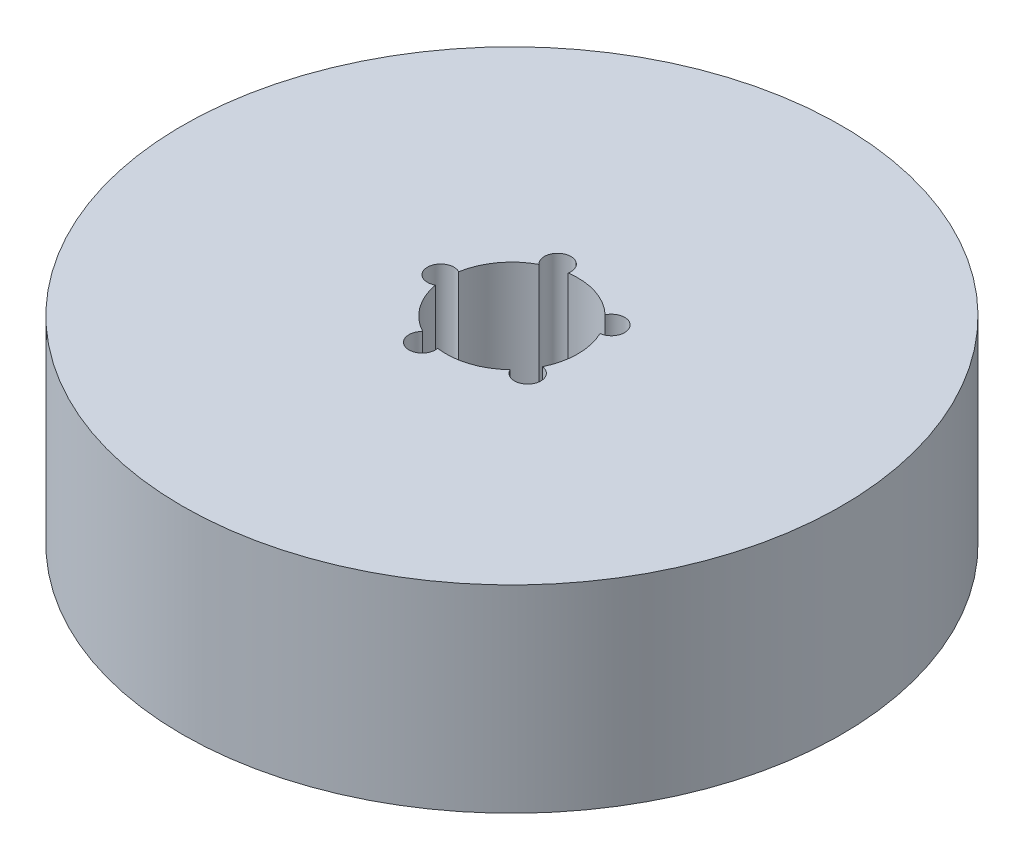
ISO-10303-21;
HEADER;
FILE_DESCRIPTION(('STEP AP214'),'2;1');
FILE_NAME('part.step','',(''),(''),'','','');
FILE_SCHEMA(('AUTOMOTIVE_DESIGN { 1 0 10303 214 1 1 1 1 }'));
ENDSEC;
DATA;
#1=APPLICATION_CONTEXT('core data for automotive mechanical design processes');
#2=APPLICATION_PROTOCOL_DEFINITION('international standard','automotive_design',2000,#1);
#3=PRODUCT_CONTEXT('',#1,'mechanical');
#4=PRODUCT('Part','Part','',(#3));
#5=PRODUCT_RELATED_PRODUCT_CATEGORY('part','',(#4));
#6=PRODUCT_DEFINITION_FORMATION('','',#4);
#7=PRODUCT_DEFINITION_CONTEXT('part definition',#1,'design');
#8=PRODUCT_DEFINITION('design','',#6,#7);
#9=PRODUCT_DEFINITION_SHAPE('','',#8);
#10=(LENGTH_UNIT() NAMED_UNIT(*) SI_UNIT(.MILLI.,.METRE.));
#11=(NAMED_UNIT(*) PLANE_ANGLE_UNIT() SI_UNIT($,.RADIAN.));
#12=(NAMED_UNIT(*) SI_UNIT($,.STERADIAN.) SOLID_ANGLE_UNIT());
#13=UNCERTAINTY_MEASURE_WITH_UNIT(LENGTH_MEASURE(1.E-05),#10,'distance_accuracy_value','');
#14=(GEOMETRIC_REPRESENTATION_CONTEXT(3) GLOBAL_UNCERTAINTY_ASSIGNED_CONTEXT((#13)) GLOBAL_UNIT_ASSIGNED_CONTEXT((#10,
#11,#12)) REPRESENTATION_CONTEXT('',''));
#15=CARTESIAN_POINT('',(0.,0.,0.));
#16=DIRECTION('',(0.,0.,1.));
#17=DIRECTION('',(1.,0.,0.));
#18=AXIS2_PLACEMENT_3D('',#15,#16,#17);
#19=CARTESIAN_POINT('',(0.,30.,0.));
#20=DIRECTION('',(0.,-1.,0.));
#21=DIRECTION('',(0.,0.,-1.));
#22=AXIS2_PLACEMENT_3D('',#19,#20,#21);
#23=CYLINDRICAL_SURFACE('',#22,50.);
#24=CARTESIAN_POINT('',(0.,30.,0.));
#25=DIRECTION('',(0.,1.,0.));
#26=DIRECTION('',(0.,0.,1.));
#27=AXIS2_PLACEMENT_3D('',#24,#25,#26);
#28=CIRCLE('',#27,50.);
#29=CARTESIAN_POINT('',(0.,30.,50.));
#30=VERTEX_POINT('',#29);
#31=EDGE_CURVE('E157',#30,#30,#28,.T.);
#32=ORIENTED_EDGE('',*,*,#31,.F.);
#33=EDGE_LOOP('',(#32));
#34=FACE_BOUND('',#33,.T.);
#35=CARTESIAN_POINT('',(0.,0.,0.));
#36=DIRECTION('',(0.,1.,0.));
#37=DIRECTION('',(0.,0.,1.));
#38=AXIS2_PLACEMENT_3D('',#35,#36,#37);
#39=CIRCLE('',#38,50.);
#40=CARTESIAN_POINT('',(0.,0.,50.));
#41=VERTEX_POINT('',#40);
#42=EDGE_CURVE('E150',#41,#41,#39,.T.);
#43=ORIENTED_EDGE('',*,*,#42,.T.);
#44=EDGE_LOOP('',(#43));
#45=FACE_BOUND('',#44,.T.);
#46=ADVANCED_FACE('F39',(#34,#45),#23,.T.);
#47=CARTESIAN_POINT('',(0.,30.,0.));
#48=DIRECTION('',(0.,1.,0.));
#49=DIRECTION('',(0.,0.,1.));
#50=AXIS2_PLACEMENT_3D('',#47,#48,#49);
#51=PLANE('',#50);
#52=CARTESIAN_POINT('',(-3.33869277643538,30.,-10.2754397937207));
#53=DIRECTION('',(0.,1.,0.));
#54=DIRECTION('',(-0.95105651629515,0.,0.309016994374958));
#55=AXIS2_PLACEMENT_3D('',#52,#53,#54);
#56=CIRCLE('',#55,2.00900339087471);
#57=CARTESIAN_POINT('',(-1.36384540924019,30.,-9.90655973078921));
#58=VERTEX_POINT('',#57);
#59=CARTESIAN_POINT('',(-4.71955559693702,30.,-8.81622339595705));
#60=VERTEX_POINT('',#59);
#61=EDGE_CURVE('E194',#58,#60,#56,.T.);
#62=ORIENTED_EDGE('',*,*,#61,.F.);
#63=CARTESIAN_POINT('',(0.,30.,0.));
#64=DIRECTION('',(0.,1.,0.));
#65=DIRECTION('',(0.,0.,1.));
#66=AXIS2_PLACEMENT_3D('',#63,#64,#65);
#67=CIRCLE('',#66,10.);
#68=CARTESIAN_POINT('',(6.92630382448782,30.,-7.21292696004094));
#69=VERTEX_POINT('',#68);
#70=EDGE_CURVE('E147',#69,#58,#67,.T.);
#71=ORIENTED_EDGE('',*,*,#70,.F.);
#72=CARTESIAN_POINT('',(8.74081116670121,30.,-6.3505710418727));
#73=DIRECTION('',(0.,1.,0.));
#74=DIRECTION('',(-0.58778525229248,0.,-0.809016994374942));
#75=AXIS2_PLACEMENT_3D('',#72,#73,#74);
#76=CIRCLE('',#75,2.00900339087471);
#77=CARTESIAN_POINT('',(9.00024677687878,30.,-4.35838937628146));
#78=VERTEX_POINT('',#77);
#79=EDGE_CURVE('E254',#78,#69,#76,.T.);
#80=ORIENTED_EDGE('',*,*,#79,.F.);
#81=CARTESIAN_POINT('',(9.00024677687884,30.,4.35838937628133));
#82=VERTEX_POINT('',#81);
#83=EDGE_CURVE('E144',#82,#78,#67,.T.);
#84=ORIENTED_EDGE('',*,*,#83,.F.);
#85=CARTESIAN_POINT('',(8.7408111667013,30.,6.35057104187258));
#86=DIRECTION('',(0.,1.,0.));
#87=DIRECTION('',(0.587785252292469,0.,-0.809016994374951));
#88=AXIS2_PLACEMENT_3D('',#85,#86,#87);
#89=CIRCLE('',#88,2.00900339087471);
#90=CARTESIAN_POINT('',(6.92630382448792,30.,7.21292696004084));
#91=VERTEX_POINT('',#90);
#92=EDGE_CURVE('E141',#91,#82,#89,.T.);
#93=ORIENTED_EDGE('',*,*,#92,.F.);
#94=CARTESIAN_POINT('',(-1.36384540924005,30.,9.90655973078923));
#95=VERTEX_POINT('',#94);
#96=EDGE_CURVE('E134',#95,#91,#67,.T.);
#97=ORIENTED_EDGE('',*,*,#96,.F.);
#98=CARTESIAN_POINT('',(-3.33869277643523,30.,10.2754397937208));
#99=DIRECTION('',(0.,1.,0.));
#100=DIRECTION('',(0.951056516295155,0.,0.309016994374945));
#101=AXIS2_PLACEMENT_3D('',#98,#99,#100);
#102=CIRCLE('',#101,2.00900339087471);
#103=CARTESIAN_POINT('',(-4.71955559693689,30.,8.81622339595712));
#104=VERTEX_POINT('',#103);
#105=EDGE_CURVE('E111',#104,#95,#102,.T.);
#106=ORIENTED_EDGE('',*,*,#105,.F.);
#107=CARTESIAN_POINT('',(-9.8431495951897,30.,1.76420124892737));
#108=VERTEX_POINT('',#107);
#109=EDGE_CURVE('E145',#108,#104,#67,.T.);
#110=ORIENTED_EDGE('',*,*,#109,.F.);
#111=CARTESIAN_POINT('',(-10.804236780532,30.,0.));
#112=DIRECTION('',(0.,1.,0.));
#113=DIRECTION('',(0.,0.,1.));
#114=AXIS2_PLACEMENT_3D('',#111,#112,#113);
#115=CIRCLE('',#114,2.00900339087471);
#116=CARTESIAN_POINT('',(-9.8431495951897,30.,-1.76420124892737));
#117=VERTEX_POINT('',#116);
#118=EDGE_CURVE('E153',#117,#108,#115,.T.);
#119=ORIENTED_EDGE('',*,*,#118,.F.);
#120=EDGE_CURVE('E146',#60,#117,#67,.T.);
#121=ORIENTED_EDGE('',*,*,#120,.F.);
#122=EDGE_LOOP('',(#62,#71,#80,#84,#93,#97,#106,#110,#119,#121));
#123=FACE_BOUND('',#122,.T.);
#124=ORIENTED_EDGE('',*,*,#31,.T.);
#125=EDGE_LOOP('',(#124));
#126=FACE_BOUND('',#125,.T.);
#127=ADVANCED_FACE('F139',(#123,#126),#51,.T.);
#128=CARTESIAN_POINT('',(0.,0.,0.));
#129=DIRECTION('',(0.,1.,0.));
#130=DIRECTION('',(0.,0.,1.));
#131=AXIS2_PLACEMENT_3D('',#128,#129,#130);
#132=PLANE('',#131);
#133=CARTESIAN_POINT('',(0.,0.,0.));
#134=DIRECTION('',(0.,1.,0.));
#135=DIRECTION('',(0.,0.,1.));
#136=AXIS2_PLACEMENT_3D('',#133,#134,#135);
#137=CIRCLE('',#136,10.);
#138=CARTESIAN_POINT('',(0.,0.,10.));
#139=VERTEX_POINT('',#138);
#140=EDGE_CURVE('E154',#139,#139,#137,.T.);
#141=ORIENTED_EDGE('',*,*,#140,.T.);
#142=EDGE_LOOP('',(#141));
#143=FACE_BOUND('',#142,.T.);
#144=ORIENTED_EDGE('',*,*,#42,.F.);
#145=EDGE_LOOP('',(#144));
#146=FACE_BOUND('',#145,.T.);
#147=ADVANCED_FACE('F213',(#143,#146),#132,.F.);
#148=CARTESIAN_POINT('',(0.,30.,0.));
#149=DIRECTION('',(0.,-1.,0.));
#150=DIRECTION('',(0.,0.,-1.));
#151=AXIS2_PLACEMENT_3D('',#148,#149,#150);
#152=CYLINDRICAL_SURFACE('',#151,10.);
#153=DIRECTION('',(0.,1.,0.));
#154=VECTOR('',#153,1.);
#155=CARTESIAN_POINT('',(-1.36384540924019,17.4263082114023,-9.90655973078921));
#156=LINE('',#155,#154);
#157=CARTESIAN_POINT('',(-1.36384540924019,4.85261642280456,-9.90655973078921));
#158=VERTEX_POINT('',#157);
#159=EDGE_CURVE('E11',#158,#58,#156,.T.);
#160=ORIENTED_EDGE('',*,*,#159,.F.);
#161=CARTESIAN_POINT('',(0.,4.85261642280456,0.));
#162=DIRECTION('',(0.,1.,0.));
#163=DIRECTION('',(0.,0.,1.));
#164=AXIS2_PLACEMENT_3D('',#161,#162,#163);
#165=CIRCLE('',#164,10.);
#166=CARTESIAN_POINT('',(-4.71955559693702,4.85261642280456,-8.81622339595705));
#167=VERTEX_POINT('',#166);
#168=EDGE_CURVE('E189',#158,#167,#165,.T.);
#169=ORIENTED_EDGE('',*,*,#168,.T.);
#170=DIRECTION('',(0.,1.,0.));
#171=VECTOR('',#170,1.);
#172=CARTESIAN_POINT('',(-4.71955559693702,17.4263082114023,-8.81622339595705));
#173=LINE('',#172,#171);
#174=EDGE_CURVE('E46',#60,#167,#173,.F.);
#175=ORIENTED_EDGE('',*,*,#174,.F.);
#176=ORIENTED_EDGE('',*,*,#120,.T.);
#177=DIRECTION('',(0.,1.,0.));
#178=VECTOR('',#177,1.);
#179=CARTESIAN_POINT('',(-9.8431495951897,17.4263082114023,-1.76420124892737));
#180=LINE('',#179,#178);
#181=CARTESIAN_POINT('',(-9.8431495951897,4.85261642280456,-1.76420124892737));
#182=VERTEX_POINT('',#181);
#183=EDGE_CURVE('E168',#182,#117,#180,.T.);
#184=ORIENTED_EDGE('',*,*,#183,.F.);
#185=CARTESIAN_POINT('',(0.,4.85261642280456,0.));
#186=DIRECTION('',(0.,1.,0.));
#187=DIRECTION('',(0.,0.,1.));
#188=AXIS2_PLACEMENT_3D('',#185,#186,#187);
#189=CIRCLE('',#188,10.);
#190=CARTESIAN_POINT('',(-9.8431495951897,4.85261642280456,1.76420124892737));
#191=VERTEX_POINT('',#190);
#192=EDGE_CURVE('E165',#182,#191,#189,.T.);
#193=ORIENTED_EDGE('',*,*,#192,.T.);
#194=DIRECTION('',(0.,1.,0.));
#195=VECTOR('',#194,1.);
#196=CARTESIAN_POINT('',(-9.8431495951897,17.4263082114023,1.76420124892737));
#197=LINE('',#196,#195);
#198=EDGE_CURVE('E170',#108,#191,#197,.F.);
#199=ORIENTED_EDGE('',*,*,#198,.F.);
#200=ORIENTED_EDGE('',*,*,#109,.T.);
#201=DIRECTION('',(0.,1.,0.));
#202=VECTOR('',#201,1.);
#203=CARTESIAN_POINT('',(-4.7195555969369,17.4263082114023,8.81622339595712));
#204=LINE('',#203,#202);
#205=CARTESIAN_POINT('',(-4.71955559693689,4.85261642280456,8.81622339595712));
#206=VERTEX_POINT('',#205);
#207=EDGE_CURVE('E121',#206,#104,#204,.T.);
#208=ORIENTED_EDGE('',*,*,#207,.F.);
#209=CARTESIAN_POINT('',(0.,4.85261642280456,0.));
#210=DIRECTION('',(0.,1.,0.));
#211=DIRECTION('',(0.,0.,1.));
#212=AXIS2_PLACEMENT_3D('',#209,#210,#211);
#213=CIRCLE('',#212,10.);
#214=CARTESIAN_POINT('',(-1.36384540924005,4.85261642280456,9.90655973078923));
#215=VERTEX_POINT('',#214);
#216=EDGE_CURVE('E136',#206,#215,#213,.T.);
#217=ORIENTED_EDGE('',*,*,#216,.T.);
#218=DIRECTION('',(0.,1.,0.));
#219=VECTOR('',#218,1.);
#220=CARTESIAN_POINT('',(-1.36384540924005,17.4263082114023,9.90655973078923));
#221=LINE('',#220,#219);
#222=EDGE_CURVE('E117',#95,#215,#221,.F.);
#223=ORIENTED_EDGE('',*,*,#222,.F.);
#224=ORIENTED_EDGE('',*,*,#96,.T.);
#225=DIRECTION('',(0.,1.,0.));
#226=VECTOR('',#225,1.);
#227=CARTESIAN_POINT('',(6.92630382448792,17.4263082114023,7.21292696004084));
#228=LINE('',#227,#226);
#229=CARTESIAN_POINT('',(6.92630382448792,4.85261642280456,7.21292696004084));
#230=VERTEX_POINT('',#229);
#231=EDGE_CURVE('E182',#230,#91,#228,.T.);
#232=ORIENTED_EDGE('',*,*,#231,.F.);
#233=CARTESIAN_POINT('',(0.,4.85261642280456,0.));
#234=DIRECTION('',(0.,1.,0.));
#235=DIRECTION('',(0.,0.,1.));
#236=AXIS2_PLACEMENT_3D('',#233,#234,#235);
#237=CIRCLE('',#236,10.);
#238=CARTESIAN_POINT('',(9.00024677687884,4.85261642280456,4.35838937628133));
#239=VERTEX_POINT('',#238);
#240=EDGE_CURVE('E174',#230,#239,#237,.T.);
#241=ORIENTED_EDGE('',*,*,#240,.T.);
#242=DIRECTION('',(0.,1.,0.));
#243=VECTOR('',#242,1.);
#244=CARTESIAN_POINT('',(9.00024677687884,17.4263082114023,4.35838937628133));
#245=LINE('',#244,#243);
#246=EDGE_CURVE('E177',#82,#239,#245,.F.);
#247=ORIENTED_EDGE('',*,*,#246,.F.);
#248=ORIENTED_EDGE('',*,*,#83,.T.);
#249=DIRECTION('',(0.,1.,0.));
#250=VECTOR('',#249,1.);
#251=CARTESIAN_POINT('',(9.00024677687878,17.4263082114023,-4.35838937628147));
#252=LINE('',#251,#250);
#253=CARTESIAN_POINT('',(9.00024677687878,4.85261642280456,-4.35838937628146));
#254=VERTEX_POINT('',#253);
#255=EDGE_CURVE('E187',#254,#78,#252,.T.);
#256=ORIENTED_EDGE('',*,*,#255,.F.);
#257=CARTESIAN_POINT('',(0.,4.85261642280456,0.));
#258=DIRECTION('',(0.,1.,0.));
#259=DIRECTION('',(0.,0.,1.));
#260=AXIS2_PLACEMENT_3D('',#257,#258,#259);
#261=CIRCLE('',#260,10.);
#262=CARTESIAN_POINT('',(6.92630382448782,4.85261642280456,-7.21292696004094));
#263=VERTEX_POINT('',#262);
#264=EDGE_CURVE('E181',#254,#263,#261,.T.);
#265=ORIENTED_EDGE('',*,*,#264,.T.);
#266=DIRECTION('',(0.,1.,0.));
#267=VECTOR('',#266,1.);
#268=CARTESIAN_POINT('',(6.92630382448782,17.4263082114023,-7.21292696004094));
#269=LINE('',#268,#267);
#270=EDGE_CURVE('E186',#69,#263,#269,.F.);
#271=ORIENTED_EDGE('',*,*,#270,.F.);
#272=ORIENTED_EDGE('',*,*,#70,.T.);
#273=EDGE_LOOP('',(#160,#169,#175,#176,#184,#193,#199,#200,#208,#217,#223,#224,#232,#241,#247,
#248,#256,#265,#271,#272));
#274=FACE_BOUND('',#273,.T.);
#275=ORIENTED_EDGE('',*,*,#140,.F.);
#276=EDGE_LOOP('',(#275));
#277=FACE_BOUND('',#276,.T.);
#278=ADVANCED_FACE('F135',(#274,#277),#152,.F.);
#279=CARTESIAN_POINT('',(-10.804236780532,4.85261642280456,0.));
#280=DIRECTION('',(0.,1.,0.));
#281=DIRECTION('',(0.,0.,1.));
#282=AXIS2_PLACEMENT_3D('',#279,#280,#281);
#283=CYLINDRICAL_SURFACE('',#282,2.00900339087471);
#284=ORIENTED_EDGE('',*,*,#183,.T.);
#285=ORIENTED_EDGE('',*,*,#118,.T.);
#286=ORIENTED_EDGE('',*,*,#198,.T.);
#287=CARTESIAN_POINT('',(-10.804236780532,4.85261642280456,0.));
#288=DIRECTION('',(0.,1.,0.));
#289=DIRECTION('',(0.,0.,1.));
#290=AXIS2_PLACEMENT_3D('',#287,#288,#289);
#291=CIRCLE('',#290,2.00900339087471);
#292=EDGE_CURVE('E158',#182,#191,#291,.T.);
#293=ORIENTED_EDGE('',*,*,#292,.F.);
#294=EDGE_LOOP('',(#284,#285,#286,#293));
#295=FACE_BOUND('',#294,.T.);
#296=ADVANCED_FACE('F221',(#295),#283,.F.);
#297=CARTESIAN_POINT('',(-10.804236780532,4.85261642280456,0.));
#298=DIRECTION('',(0.,1.,0.));
#299=DIRECTION('',(0.,0.,1.));
#300=AXIS2_PLACEMENT_3D('',#297,#298,#299);
#301=PLANE('',#300);
#302=ORIENTED_EDGE('',*,*,#292,.T.);
#303=ORIENTED_EDGE('',*,*,#192,.F.);
#304=EDGE_LOOP('',(#302,#303));
#305=FACE_BOUND('',#304,.T.);
#306=ADVANCED_FACE('F227',(#305),#301,.T.);
#307=CARTESIAN_POINT('',(-3.33869277643523,4.85261642280456,10.2754397937208));
#308=DIRECTION('',(0.,1.,0.));
#309=DIRECTION('',(0.,0.,1.));
#310=AXIS2_PLACEMENT_3D('',#307,#308,#309);
#311=CYLINDRICAL_SURFACE('',#310,2.00900339087471);
#312=ORIENTED_EDGE('',*,*,#207,.T.);
#313=ORIENTED_EDGE('',*,*,#105,.T.);
#314=ORIENTED_EDGE('',*,*,#222,.T.);
#315=CARTESIAN_POINT('',(-3.33869277643523,4.85261642280456,10.2754397937208));
#316=DIRECTION('',(0.,1.,0.));
#317=DIRECTION('',(0.951056516295155,0.,0.309016994374945));
#318=AXIS2_PLACEMENT_3D('',#315,#316,#317);
#319=CIRCLE('',#318,2.00900339087471);
#320=EDGE_CURVE('E127',#206,#215,#319,.T.);
#321=ORIENTED_EDGE('',*,*,#320,.F.);
#322=EDGE_LOOP('',(#312,#313,#314,#321));
#323=FACE_BOUND('',#322,.T.);
#324=ADVANCED_FACE('F116',(#323),#311,.F.);
#325=CARTESIAN_POINT('',(-3.33869277643523,4.85261642280456,10.2754397937208));
#326=DIRECTION('',(0.,1.,0.));
#327=DIRECTION('',(0.951056516295155,0.,0.309016994374945));
#328=AXIS2_PLACEMENT_3D('',#325,#326,#327);
#329=PLANE('',#328);
#330=ORIENTED_EDGE('',*,*,#320,.T.);
#331=ORIENTED_EDGE('',*,*,#216,.F.);
#332=EDGE_LOOP('',(#330,#331));
#333=FACE_BOUND('',#332,.T.);
#334=ADVANCED_FACE('F234',(#333),#329,.T.);
#335=CARTESIAN_POINT('',(8.7408111667013,4.85261642280456,6.35057104187258));
#336=DIRECTION('',(0.,1.,0.));
#337=DIRECTION('',(0.,0.,1.));
#338=AXIS2_PLACEMENT_3D('',#335,#336,#337);
#339=CYLINDRICAL_SURFACE('',#338,2.00900339087471);
#340=ORIENTED_EDGE('',*,*,#231,.T.);
#341=ORIENTED_EDGE('',*,*,#92,.T.);
#342=ORIENTED_EDGE('',*,*,#246,.T.);
#343=CARTESIAN_POINT('',(8.7408111667013,4.85261642280456,6.35057104187258));
#344=DIRECTION('',(0.,1.,0.));
#345=DIRECTION('',(0.587785252292469,0.,-0.809016994374951));
#346=AXIS2_PLACEMENT_3D('',#343,#344,#345);
#347=CIRCLE('',#346,2.00900339087471);
#348=EDGE_CURVE('E130',#230,#239,#347,.T.);
#349=ORIENTED_EDGE('',*,*,#348,.F.);
#350=EDGE_LOOP('',(#340,#341,#342,#349));
#351=FACE_BOUND('',#350,.T.);
#352=ADVANCED_FACE('F240',(#351),#339,.F.);
#353=CARTESIAN_POINT('',(8.7408111667013,4.85261642280456,6.35057104187258));
#354=DIRECTION('',(0.,1.,0.));
#355=DIRECTION('',(0.587785252292469,0.,-0.809016994374951));
#356=AXIS2_PLACEMENT_3D('',#353,#354,#355);
#357=PLANE('',#356);
#358=ORIENTED_EDGE('',*,*,#348,.T.);
#359=ORIENTED_EDGE('',*,*,#240,.F.);
#360=EDGE_LOOP('',(#358,#359));
#361=FACE_BOUND('',#360,.T.);
#362=ADVANCED_FACE('F245',(#361),#357,.T.);
#363=CARTESIAN_POINT('',(8.74081116670121,4.85261642280456,-6.3505710418727));
#364=DIRECTION('',(0.,1.,0.));
#365=DIRECTION('',(0.,0.,1.));
#366=AXIS2_PLACEMENT_3D('',#363,#364,#365);
#367=CYLINDRICAL_SURFACE('',#366,2.00900339087471);
#368=ORIENTED_EDGE('',*,*,#255,.T.);
#369=ORIENTED_EDGE('',*,*,#79,.T.);
#370=ORIENTED_EDGE('',*,*,#270,.T.);
#371=CARTESIAN_POINT('',(8.74081116670121,4.85261642280456,-6.3505710418727));
#372=DIRECTION('',(0.,1.,0.));
#373=DIRECTION('',(-0.58778525229248,0.,-0.809016994374942));
#374=AXIS2_PLACEMENT_3D('',#371,#372,#373);
#375=CIRCLE('',#374,2.00900339087471);
#376=EDGE_CURVE('E56',#254,#263,#375,.T.);
#377=ORIENTED_EDGE('',*,*,#376,.F.);
#378=EDGE_LOOP('',(#368,#369,#370,#377));
#379=FACE_BOUND('',#378,.T.);
#380=ADVANCED_FACE('F266',(#379),#367,.F.);
#381=CARTESIAN_POINT('',(8.74081116670121,4.85261642280456,-6.3505710418727));
#382=DIRECTION('',(0.,1.,0.));
#383=DIRECTION('',(-0.58778525229248,0.,-0.809016994374942));
#384=AXIS2_PLACEMENT_3D('',#381,#382,#383);
#385=PLANE('',#384);
#386=ORIENTED_EDGE('',*,*,#376,.T.);
#387=ORIENTED_EDGE('',*,*,#264,.F.);
#388=EDGE_LOOP('',(#386,#387));
#389=FACE_BOUND('',#388,.T.);
#390=ADVANCED_FACE('F204',(#389),#385,.T.);
#391=CARTESIAN_POINT('',(-3.33869277643538,4.85261642280456,-10.2754397937207));
#392=DIRECTION('',(0.,1.,0.));
#393=DIRECTION('',(0.,0.,1.));
#394=AXIS2_PLACEMENT_3D('',#391,#392,#393);
#395=CYLINDRICAL_SURFACE('',#394,2.00900339087471);
#396=ORIENTED_EDGE('',*,*,#159,.T.);
#397=ORIENTED_EDGE('',*,*,#61,.T.);
#398=ORIENTED_EDGE('',*,*,#174,.T.);
#399=CARTESIAN_POINT('',(-3.33869277643538,4.85261642280456,-10.2754397937207));
#400=DIRECTION('',(0.,1.,0.));
#401=DIRECTION('',(-0.95105651629515,0.,0.309016994374958));
#402=AXIS2_PLACEMENT_3D('',#399,#400,#401);
#403=CIRCLE('',#402,2.00900339087471);
#404=EDGE_CURVE('E55',#158,#167,#403,.T.);
#405=ORIENTED_EDGE('',*,*,#404,.F.);
#406=EDGE_LOOP('',(#396,#397,#398,#405));
#407=FACE_BOUND('',#406,.T.);
#408=ADVANCED_FACE('F193',(#407),#395,.F.);
#409=CARTESIAN_POINT('',(-3.33869277643538,4.85261642280456,-10.2754397937207));
#410=DIRECTION('',(0.,1.,0.));
#411=DIRECTION('',(-0.95105651629515,0.,0.309016994374958));
#412=AXIS2_PLACEMENT_3D('',#409,#410,#411);
#413=PLANE('',#412);
#414=ORIENTED_EDGE('',*,*,#404,.T.);
#415=ORIENTED_EDGE('',*,*,#168,.F.);
#416=EDGE_LOOP('',(#414,#415));
#417=FACE_BOUND('',#416,.T.);
#418=ADVANCED_FACE('F196',(#417),#413,.T.);
#419=CLOSED_SHELL('',(#46,#127,#147,#278,#296,#306,#324,#334,#352,#362,#380,#390,#408,#418));
#420=MANIFOLD_SOLID_BREP('B2',#419);
#421=ADVANCED_BREP_SHAPE_REPRESENTATION('',(#18,#420),#14);
#422=SHAPE_DEFINITION_REPRESENTATION(#9,#421);
ENDSEC;
END-ISO-10303-21;
